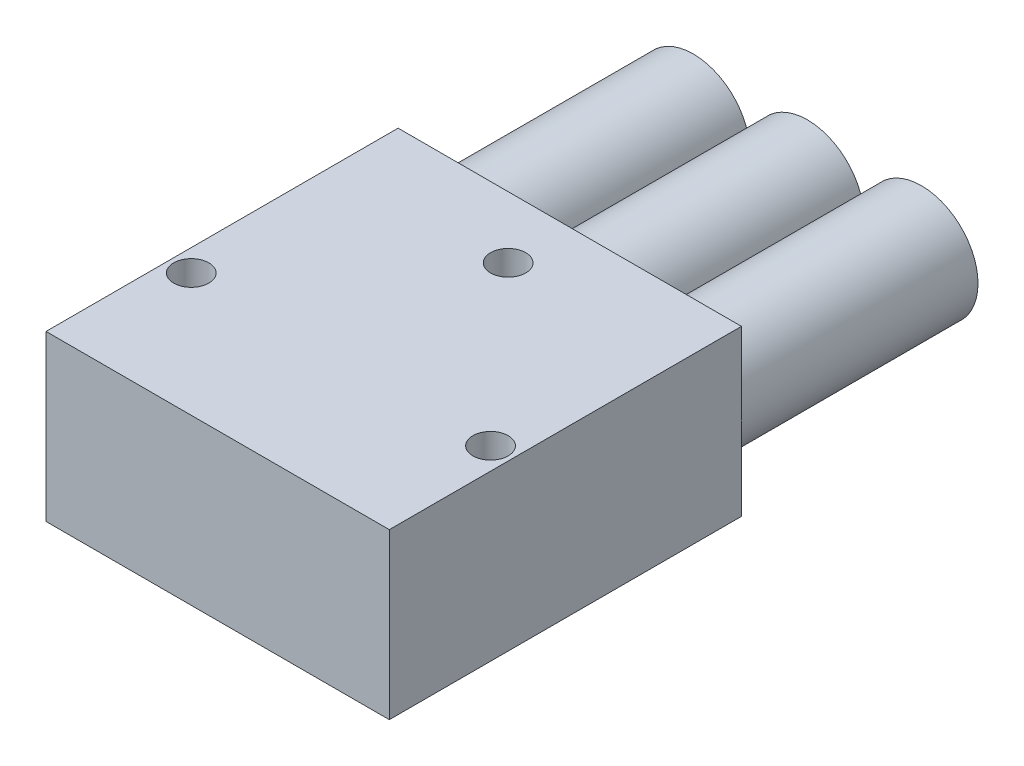
ISO-10303-21;
HEADER;
FILE_DESCRIPTION(('STEP AP214'),'2;1');
FILE_NAME('part.step','',(''),(''),'','','');
FILE_SCHEMA(('AUTOMOTIVE_DESIGN { 1 0 10303 214 1 1 1 1 }'));
ENDSEC;
DATA;
#1=APPLICATION_CONTEXT('core data for automotive mechanical design processes');
#2=APPLICATION_PROTOCOL_DEFINITION('international standard','automotive_design',2000,#1);
#3=PRODUCT_CONTEXT('',#1,'mechanical');
#4=PRODUCT('Part','Part','',(#3));
#5=PRODUCT_RELATED_PRODUCT_CATEGORY('part','',(#4));
#6=PRODUCT_DEFINITION_FORMATION('','',#4);
#7=PRODUCT_DEFINITION_CONTEXT('part definition',#1,'design');
#8=PRODUCT_DEFINITION('design','',#6,#7);
#9=PRODUCT_DEFINITION_SHAPE('','',#8);
#10=(LENGTH_UNIT() NAMED_UNIT(*) SI_UNIT(.MILLI.,.METRE.));
#11=(NAMED_UNIT(*) PLANE_ANGLE_UNIT() SI_UNIT($,.RADIAN.));
#12=(NAMED_UNIT(*) SI_UNIT($,.STERADIAN.) SOLID_ANGLE_UNIT());
#13=UNCERTAINTY_MEASURE_WITH_UNIT(LENGTH_MEASURE(1.E-05),#10,'distance_accuracy_value','');
#14=(GEOMETRIC_REPRESENTATION_CONTEXT(3) GLOBAL_UNCERTAINTY_ASSIGNED_CONTEXT((#13)) GLOBAL_UNIT_ASSIGNED_CONTEXT((#10,
#11,#12)) REPRESENTATION_CONTEXT('',''));
#15=CARTESIAN_POINT('',(0.,0.,0.));
#16=DIRECTION('',(0.,0.,1.));
#17=DIRECTION('',(1.,0.,0.));
#18=AXIS2_PLACEMENT_3D('',#15,#16,#17);
#19=CARTESIAN_POINT('',(0.,18.7,0.));
#20=DIRECTION('',(1.,0.,0.));
#21=DIRECTION('',(0.,0.,-1.));
#22=AXIS2_PLACEMENT_3D('',#19,#20,#21);
#23=PLANE('',#22);
#24=DIRECTION('',(0.,0.,1.));
#25=VECTOR('',#24,1.);
#26=CARTESIAN_POINT('',(0.,0.,0.));
#27=LINE('',#26,#25);
#28=CARTESIAN_POINT('',(0.,0.,-40.));
#29=VERTEX_POINT('',#28);
#30=CARTESIAN_POINT('',(0.,0.,0.));
#31=VERTEX_POINT('',#30);
#32=EDGE_CURVE('E111',#29,#31,#27,.T.);
#33=ORIENTED_EDGE('',*,*,#32,.T.);
#34=DIRECTION('',(0.,-1.,0.));
#35=VECTOR('',#34,1.);
#36=CARTESIAN_POINT('',(0.,18.7,0.));
#37=LINE('',#36,#35);
#38=CARTESIAN_POINT('',(0.,18.7,0.));
#39=VERTEX_POINT('',#38);
#40=EDGE_CURVE('E100',#39,#31,#37,.T.);
#41=ORIENTED_EDGE('',*,*,#40,.F.);
#42=DIRECTION('',(0.,0.,1.));
#43=VECTOR('',#42,1.);
#44=CARTESIAN_POINT('',(0.,18.7,0.));
#45=LINE('',#44,#43);
#46=CARTESIAN_POINT('',(0.,18.7,-40.));
#47=VERTEX_POINT('',#46);
#48=EDGE_CURVE('E92',#47,#39,#45,.T.);
#49=ORIENTED_EDGE('',*,*,#48,.F.);
#50=DIRECTION('',(0.,-1.,0.));
#51=VECTOR('',#50,1.);
#52=CARTESIAN_POINT('',(0.,18.7,-40.));
#53=LINE('',#52,#51);
#54=EDGE_CURVE('E107',#47,#29,#53,.T.);
#55=ORIENTED_EDGE('',*,*,#54,.T.);
#56=EDGE_LOOP('',(#33,#41,#49,#55));
#57=FACE_BOUND('',#56,.T.);
#58=ADVANCED_FACE('F39',(#57),#23,.F.);
#59=CARTESIAN_POINT('',(0.,18.7,0.));
#60=DIRECTION('',(0.,0.,-1.));
#61=DIRECTION('',(-1.,0.,0.));
#62=AXIS2_PLACEMENT_3D('',#59,#60,#61);
#63=PLANE('',#62);
#64=DIRECTION('',(1.,0.,0.));
#65=VECTOR('',#64,1.);
#66=CARTESIAN_POINT('',(0.,0.,0.));
#67=LINE('',#66,#65);
#68=CARTESIAN_POINT('',(39.,0.,0.));
#69=VERTEX_POINT('',#68);
#70=EDGE_CURVE('E98',#31,#69,#67,.T.);
#71=ORIENTED_EDGE('',*,*,#70,.T.);
#72=DIRECTION('',(0.,-1.,0.));
#73=VECTOR('',#72,1.);
#74=CARTESIAN_POINT('',(39.,18.7,0.));
#75=LINE('',#74,#73);
#76=CARTESIAN_POINT('',(39.,18.7,0.));
#77=VERTEX_POINT('',#76);
#78=EDGE_CURVE('E96',#77,#69,#75,.T.);
#79=ORIENTED_EDGE('',*,*,#78,.F.);
#80=DIRECTION('',(1.,0.,0.));
#81=VECTOR('',#80,1.);
#82=CARTESIAN_POINT('',(0.,18.7,0.));
#83=LINE('',#82,#81);
#84=EDGE_CURVE('E87',#39,#77,#83,.T.);
#85=ORIENTED_EDGE('',*,*,#84,.F.);
#86=ORIENTED_EDGE('',*,*,#40,.T.);
#87=EDGE_LOOP('',(#71,#79,#85,#86));
#88=FACE_BOUND('',#87,.T.);
#89=ADVANCED_FACE('F97',(#88),#63,.F.);
#90=CARTESIAN_POINT('',(39.,18.7,0.));
#91=DIRECTION('',(-1.,0.,0.));
#92=DIRECTION('',(0.,0.,1.));
#93=AXIS2_PLACEMENT_3D('',#90,#91,#92);
#94=PLANE('',#93);
#95=DIRECTION('',(0.,0.,-1.));
#96=VECTOR('',#95,1.);
#97=CARTESIAN_POINT('',(39.,0.,0.));
#98=LINE('',#97,#96);
#99=CARTESIAN_POINT('',(39.,0.,-40.));
#100=VERTEX_POINT('',#99);
#101=EDGE_CURVE('E73',#69,#100,#98,.T.);
#102=ORIENTED_EDGE('',*,*,#101,.T.);
#103=DIRECTION('',(0.,-1.,0.));
#104=VECTOR('',#103,1.);
#105=CARTESIAN_POINT('',(39.,18.7,-40.));
#106=LINE('',#105,#104);
#107=CARTESIAN_POINT('',(39.,18.7,-40.));
#108=VERTEX_POINT('',#107);
#109=EDGE_CURVE('E101',#108,#100,#106,.T.);
#110=ORIENTED_EDGE('',*,*,#109,.F.);
#111=DIRECTION('',(0.,0.,-1.));
#112=VECTOR('',#111,1.);
#113=CARTESIAN_POINT('',(39.,18.7,0.));
#114=LINE('',#113,#112);
#115=EDGE_CURVE('E90',#77,#108,#114,.T.);
#116=ORIENTED_EDGE('',*,*,#115,.F.);
#117=ORIENTED_EDGE('',*,*,#78,.T.);
#118=EDGE_LOOP('',(#102,#110,#116,#117));
#119=FACE_BOUND('',#118,.T.);
#120=ADVANCED_FACE('F103',(#119),#94,.F.);
#121=CARTESIAN_POINT('',(0.,18.7,-40.));
#122=DIRECTION('',(0.,0.,1.));
#123=DIRECTION('',(1.,0.,0.));
#124=AXIS2_PLACEMENT_3D('',#121,#122,#123);
#125=PLANE('',#124);
#126=CARTESIAN_POINT('',(6.54145322062911,9.35,-40.));
#127=DIRECTION('',(0.,0.,1.));
#128=DIRECTION('',(1.,0.,0.));
#129=AXIS2_PLACEMENT_3D('',#126,#127,#128);
#130=CIRCLE('',#129,6.41709355874178);
#131=CARTESIAN_POINT('',(12.9585467793709,9.35,-40.));
#132=VERTEX_POINT('',#131);
#133=EDGE_CURVE('E11',#132,#132,#130,.F.);
#134=ORIENTED_EDGE('',*,*,#133,.F.);
#135=EDGE_LOOP('',(#134));
#136=FACE_BOUND('',#135,.T.);
#137=CARTESIAN_POINT('',(19.5,9.35,-40.));
#138=DIRECTION('',(0.,0.,1.));
#139=DIRECTION('',(1.,0.,0.));
#140=AXIS2_PLACEMENT_3D('',#137,#138,#139);
#141=CIRCLE('',#140,6.41709355874178);
#142=CARTESIAN_POINT('',(25.9170935587418,9.35,-40.));
#143=VERTEX_POINT('',#142);
#144=EDGE_CURVE('E48',#143,#143,#141,.F.);
#145=ORIENTED_EDGE('',*,*,#144,.F.);
#146=EDGE_LOOP('',(#145));
#147=FACE_BOUND('',#146,.T.);
#148=CARTESIAN_POINT('',(32.4585467793709,9.35,-40.));
#149=DIRECTION('',(0.,0.,1.));
#150=DIRECTION('',(1.,0.,0.));
#151=AXIS2_PLACEMENT_3D('',#148,#149,#150);
#152=CIRCLE('',#151,6.41709355874178);
#153=CARTESIAN_POINT('',(38.8756403381127,9.35,-40.));
#154=VERTEX_POINT('',#153);
#155=EDGE_CURVE('E128',#154,#154,#152,.F.);
#156=ORIENTED_EDGE('',*,*,#155,.F.);
#157=EDGE_LOOP('',(#156));
#158=FACE_BOUND('',#157,.T.);
#159=DIRECTION('',(-1.,0.,0.));
#160=VECTOR('',#159,1.);
#161=CARTESIAN_POINT('',(0.,0.,-40.));
#162=LINE('',#161,#160);
#163=EDGE_CURVE('E79',#100,#29,#162,.T.);
#164=ORIENTED_EDGE('',*,*,#163,.T.);
#165=ORIENTED_EDGE('',*,*,#54,.F.);
#166=DIRECTION('',(-1.,0.,0.));
#167=VECTOR('',#166,1.);
#168=CARTESIAN_POINT('',(0.,18.7,-40.));
#169=LINE('',#168,#167);
#170=EDGE_CURVE('E56',#108,#47,#169,.T.);
#171=ORIENTED_EDGE('',*,*,#170,.F.);
#172=ORIENTED_EDGE('',*,*,#109,.T.);
#173=EDGE_LOOP('',(#164,#165,#171,#172));
#174=FACE_BOUND('',#173,.T.);
#175=ADVANCED_FACE('F137',(#136,#147,#158,#174),#125,.F.);
#176=CARTESIAN_POINT('',(0.,18.7,0.));
#177=DIRECTION('',(0.,-1.,0.));
#178=DIRECTION('',(0.,0.,-1.));
#179=AXIS2_PLACEMENT_3D('',#176,#177,#178);
#180=PLANE('',#179);
#181=CARTESIAN_POINT('',(2.5,18.7,-14.));
#182=DIRECTION('',(0.,1.,0.));
#183=DIRECTION('',(0.,0.,1.));
#184=AXIS2_PLACEMENT_3D('',#181,#182,#183);
#185=CIRCLE('',#184,2.);
#186=CARTESIAN_POINT('',(2.5,18.7,-12.));
#187=VERTEX_POINT('',#186);
#188=EDGE_CURVE('E317',#187,#187,#185,.T.);
#189=ORIENTED_EDGE('',*,*,#188,.F.);
#190=EDGE_LOOP('',(#189));
#191=FACE_BOUND('',#190,.T.);
#192=CARTESIAN_POINT('',(36.5,18.7,-14.));
#193=DIRECTION('',(0.,1.,0.));
#194=DIRECTION('',(0.,0.,1.));
#195=AXIS2_PLACEMENT_3D('',#192,#193,#194);
#196=CIRCLE('',#195,2.);
#197=CARTESIAN_POINT('',(36.5,18.7,-12.));
#198=VERTEX_POINT('',#197);
#199=EDGE_CURVE('E325',#198,#198,#196,.T.);
#200=ORIENTED_EDGE('',*,*,#199,.F.);
#201=EDGE_LOOP('',(#200));
#202=FACE_BOUND('',#201,.T.);
#203=CARTESIAN_POINT('',(19.5,18.7,-33.));
#204=DIRECTION('',(0.,1.,0.));
#205=DIRECTION('',(0.,0.,1.));
#206=AXIS2_PLACEMENT_3D('',#203,#204,#205);
#207=CIRCLE('',#206,2.00000000000001);
#208=CARTESIAN_POINT('',(19.5,18.7,-31.));
#209=VERTEX_POINT('',#208);
#210=EDGE_CURVE('E313',#209,#209,#207,.T.);
#211=ORIENTED_EDGE('',*,*,#210,.F.);
#212=EDGE_LOOP('',(#211));
#213=FACE_BOUND('',#212,.T.);
#214=ORIENTED_EDGE('',*,*,#48,.T.);
#215=ORIENTED_EDGE('',*,*,#84,.T.);
#216=ORIENTED_EDGE('',*,*,#115,.T.);
#217=ORIENTED_EDGE('',*,*,#170,.T.);
#218=EDGE_LOOP('',(#214,#215,#216,#217));
#219=FACE_BOUND('',#218,.T.);
#220=ADVANCED_FACE('F88',(#191,#202,#213,#219),#180,.F.);
#221=CARTESIAN_POINT('',(0.,0.,0.));
#222=DIRECTION('',(0.,-1.,0.));
#223=DIRECTION('',(0.,0.,-1.));
#224=AXIS2_PLACEMENT_3D('',#221,#222,#223);
#225=PLANE('',#224);
#226=ORIENTED_EDGE('',*,*,#32,.F.);
#227=ORIENTED_EDGE('',*,*,#163,.F.);
#228=ORIENTED_EDGE('',*,*,#101,.F.);
#229=ORIENTED_EDGE('',*,*,#70,.F.);
#230=EDGE_LOOP('',(#226,#227,#228,#229));
#231=FACE_BOUND('',#230,.T.);
#232=ADVANCED_FACE('F167',(#231),#225,.T.);
#233=CARTESIAN_POINT('',(19.5,15.7,-33.));
#234=DIRECTION('',(0.,1.,0.));
#235=DIRECTION('',(0.,0.,1.));
#236=AXIS2_PLACEMENT_3D('',#233,#234,#235);
#237=CYLINDRICAL_SURFACE('',#236,2.00000000000001);
#238=CARTESIAN_POINT('',(19.5,15.7,-33.));
#239=DIRECTION('',(0.,1.,0.));
#240=DIRECTION('',(0.,0.,1.));
#241=AXIS2_PLACEMENT_3D('',#238,#239,#240);
#242=CIRCLE('',#241,2.00000000000001);
#243=CARTESIAN_POINT('',(19.5,15.7,-31.));
#244=VERTEX_POINT('',#243);
#245=EDGE_CURVE('E329',#244,#244,#242,.T.);
#246=ORIENTED_EDGE('',*,*,#245,.F.);
#247=EDGE_LOOP('',(#246));
#248=FACE_BOUND('',#247,.T.);
#249=ORIENTED_EDGE('',*,*,#210,.T.);
#250=EDGE_LOOP('',(#249));
#251=FACE_BOUND('',#250,.T.);
#252=ADVANCED_FACE('F169',(#248,#251),#237,.F.);
#253=CARTESIAN_POINT('',(19.5,15.7,-33.));
#254=DIRECTION('',(0.,1.,0.));
#255=DIRECTION('',(0.,0.,1.));
#256=AXIS2_PLACEMENT_3D('',#253,#254,#255);
#257=PLANE('',#256);
#258=ORIENTED_EDGE('',*,*,#245,.T.);
#259=EDGE_LOOP('',(#258));
#260=FACE_BOUND('',#259,.T.);
#261=ADVANCED_FACE('F175',(#260),#257,.T.);
#262=CARTESIAN_POINT('',(36.5,15.7,-14.));
#263=DIRECTION('',(0.,1.,0.));
#264=DIRECTION('',(0.,0.,1.));
#265=AXIS2_PLACEMENT_3D('',#262,#263,#264);
#266=CYLINDRICAL_SURFACE('',#265,2.);
#267=CARTESIAN_POINT('',(36.5,15.7,-14.));
#268=DIRECTION('',(0.,1.,0.));
#269=DIRECTION('',(0.,0.,1.));
#270=AXIS2_PLACEMENT_3D('',#267,#268,#269);
#271=CIRCLE('',#270,2.);
#272=CARTESIAN_POINT('',(36.5,15.7,-12.));
#273=VERTEX_POINT('',#272);
#274=EDGE_CURVE('E321',#273,#273,#271,.T.);
#275=ORIENTED_EDGE('',*,*,#274,.F.);
#276=EDGE_LOOP('',(#275));
#277=FACE_BOUND('',#276,.T.);
#278=ORIENTED_EDGE('',*,*,#199,.T.);
#279=EDGE_LOOP('',(#278));
#280=FACE_BOUND('',#279,.T.);
#281=ADVANCED_FACE('F212',(#277,#280),#266,.F.);
#282=CARTESIAN_POINT('',(36.5,15.7,-14.));
#283=DIRECTION('',(0.,1.,0.));
#284=DIRECTION('',(0.,0.,1.));
#285=AXIS2_PLACEMENT_3D('',#282,#283,#284);
#286=PLANE('',#285);
#287=ORIENTED_EDGE('',*,*,#274,.T.);
#288=EDGE_LOOP('',(#287));
#289=FACE_BOUND('',#288,.T.);
#290=ADVANCED_FACE('F222',(#289),#286,.T.);
#291=CARTESIAN_POINT('',(2.5,15.7,-14.));
#292=DIRECTION('',(0.,1.,0.));
#293=DIRECTION('',(0.,0.,1.));
#294=AXIS2_PLACEMENT_3D('',#291,#292,#293);
#295=CYLINDRICAL_SURFACE('',#294,2.);
#296=CARTESIAN_POINT('',(2.5,15.7,-14.));
#297=DIRECTION('',(0.,1.,0.));
#298=DIRECTION('',(0.,0.,1.));
#299=AXIS2_PLACEMENT_3D('',#296,#297,#298);
#300=CIRCLE('',#299,2.);
#301=CARTESIAN_POINT('',(2.5,15.7,-12.));
#302=VERTEX_POINT('',#301);
#303=EDGE_CURVE('E115',#302,#302,#300,.T.);
#304=ORIENTED_EDGE('',*,*,#303,.F.);
#305=EDGE_LOOP('',(#304));
#306=FACE_BOUND('',#305,.T.);
#307=ORIENTED_EDGE('',*,*,#188,.T.);
#308=EDGE_LOOP('',(#307));
#309=FACE_BOUND('',#308,.T.);
#310=ADVANCED_FACE('F156',(#306,#309),#295,.F.);
#311=CARTESIAN_POINT('',(2.5,15.7,-14.));
#312=DIRECTION('',(0.,1.,0.));
#313=DIRECTION('',(0.,0.,1.));
#314=AXIS2_PLACEMENT_3D('',#311,#312,#313);
#315=PLANE('',#314);
#316=ORIENTED_EDGE('',*,*,#303,.T.);
#317=EDGE_LOOP('',(#316));
#318=FACE_BOUND('',#317,.T.);
#319=ADVANCED_FACE('F147',(#318),#315,.T.);
#320=CARTESIAN_POINT('',(32.4585467793709,9.35,-67.));
#321=DIRECTION('',(0.,0.,1.));
#322=DIRECTION('',(1.,0.,0.));
#323=AXIS2_PLACEMENT_3D('',#320,#321,#322);
#324=CYLINDRICAL_SURFACE('',#323,6.41709355874178);
#325=CARTESIAN_POINT('',(32.4585467793709,9.35,-67.));
#326=DIRECTION('',(0.,0.,-1.));
#327=DIRECTION('',(-1.,0.,0.));
#328=AXIS2_PLACEMENT_3D('',#325,#326,#327);
#329=CIRCLE('',#328,6.41709355874178);
#330=CARTESIAN_POINT('',(26.0414532206291,9.35,-67.));
#331=VERTEX_POINT('',#330);
#332=EDGE_CURVE('E307',#331,#331,#329,.T.);
#333=ORIENTED_EDGE('',*,*,#332,.F.);
#334=EDGE_LOOP('',(#333));
#335=FACE_BOUND('',#334,.T.);
#336=ORIENTED_EDGE('',*,*,#155,.T.);
#337=EDGE_LOOP('',(#336));
#338=FACE_BOUND('',#337,.T.);
#339=ADVANCED_FACE('F144',(#335,#338),#324,.T.);
#340=CARTESIAN_POINT('',(32.4585467793709,9.35,-67.));
#341=DIRECTION('',(0.,0.,-1.));
#342=DIRECTION('',(-1.,0.,0.));
#343=AXIS2_PLACEMENT_3D('',#340,#341,#342);
#344=PLANE('',#343);
#345=ORIENTED_EDGE('',*,*,#332,.T.);
#346=EDGE_LOOP('',(#345));
#347=FACE_BOUND('',#346,.T.);
#348=ADVANCED_FACE('F146',(#347),#344,.T.);
#349=CARTESIAN_POINT('',(19.5,9.35,-67.));
#350=DIRECTION('',(0.,0.,1.));
#351=DIRECTION('',(1.,0.,0.));
#352=AXIS2_PLACEMENT_3D('',#349,#350,#351);
#353=CYLINDRICAL_SURFACE('',#352,6.41709355874178);
#354=CARTESIAN_POINT('',(19.5,9.35,-67.));
#355=DIRECTION('',(0.,0.,-1.));
#356=DIRECTION('',(-1.,0.,0.));
#357=AXIS2_PLACEMENT_3D('',#354,#355,#356);
#358=CIRCLE('',#357,6.41709355874178);
#359=CARTESIAN_POINT('',(13.0829064412582,9.35,-67.));
#360=VERTEX_POINT('',#359);
#361=EDGE_CURVE('E303',#360,#360,#358,.T.);
#362=ORIENTED_EDGE('',*,*,#361,.F.);
#363=EDGE_LOOP('',(#362));
#364=FACE_BOUND('',#363,.T.);
#365=ORIENTED_EDGE('',*,*,#144,.T.);
#366=EDGE_LOOP('',(#365));
#367=FACE_BOUND('',#366,.T.);
#368=ADVANCED_FACE('F135',(#364,#367),#353,.T.);
#369=CARTESIAN_POINT('',(19.5,9.35,-67.));
#370=DIRECTION('',(0.,0.,-1.));
#371=DIRECTION('',(-1.,0.,0.));
#372=AXIS2_PLACEMENT_3D('',#369,#370,#371);
#373=PLANE('',#372);
#374=ORIENTED_EDGE('',*,*,#361,.T.);
#375=EDGE_LOOP('',(#374));
#376=FACE_BOUND('',#375,.T.);
#377=ADVANCED_FACE('F265',(#376),#373,.T.);
#378=CARTESIAN_POINT('',(6.54145322062911,9.35,-67.));
#379=DIRECTION('',(0.,0.,1.));
#380=DIRECTION('',(1.,0.,0.));
#381=AXIS2_PLACEMENT_3D('',#378,#379,#380);
#382=CYLINDRICAL_SURFACE('',#381,6.41709355874178);
#383=CARTESIAN_POINT('',(6.54145322062911,9.35,-67.));
#384=DIRECTION('',(0.,0.,-1.));
#385=DIRECTION('',(-1.,0.,0.));
#386=AXIS2_PLACEMENT_3D('',#383,#384,#385);
#387=CIRCLE('',#386,6.41709355874178);
#388=CARTESIAN_POINT('',(0.124359661887335,9.35,-67.));
#389=VERTEX_POINT('',#388);
#390=EDGE_CURVE('E301',#389,#389,#387,.T.);
#391=ORIENTED_EDGE('',*,*,#390,.F.);
#392=EDGE_LOOP('',(#391));
#393=FACE_BOUND('',#392,.T.);
#394=ORIENTED_EDGE('',*,*,#133,.T.);
#395=EDGE_LOOP('',(#394));
#396=FACE_BOUND('',#395,.T.);
#397=ADVANCED_FACE('F274',(#393,#396),#382,.T.);
#398=CARTESIAN_POINT('',(6.54145322062911,9.35,-67.));
#399=DIRECTION('',(0.,0.,-1.));
#400=DIRECTION('',(-1.,0.,0.));
#401=AXIS2_PLACEMENT_3D('',#398,#399,#400);
#402=PLANE('',#401);
#403=ORIENTED_EDGE('',*,*,#390,.T.);
#404=EDGE_LOOP('',(#403));
#405=FACE_BOUND('',#404,.T.);
#406=ADVANCED_FACE('F283',(#405),#402,.T.);
#407=CLOSED_SHELL('',(#58,#89,#120,#175,#220,#232,#252,#261,#281,#290,#310,#319,#339,#348,#368,
#377,#397,#406));
#408=MANIFOLD_SOLID_BREP('B2',#407);
#409=ADVANCED_BREP_SHAPE_REPRESENTATION('',(#18,#408),#14);
#410=SHAPE_DEFINITION_REPRESENTATION(#9,#409);
ENDSEC;
END-ISO-10303-21;
